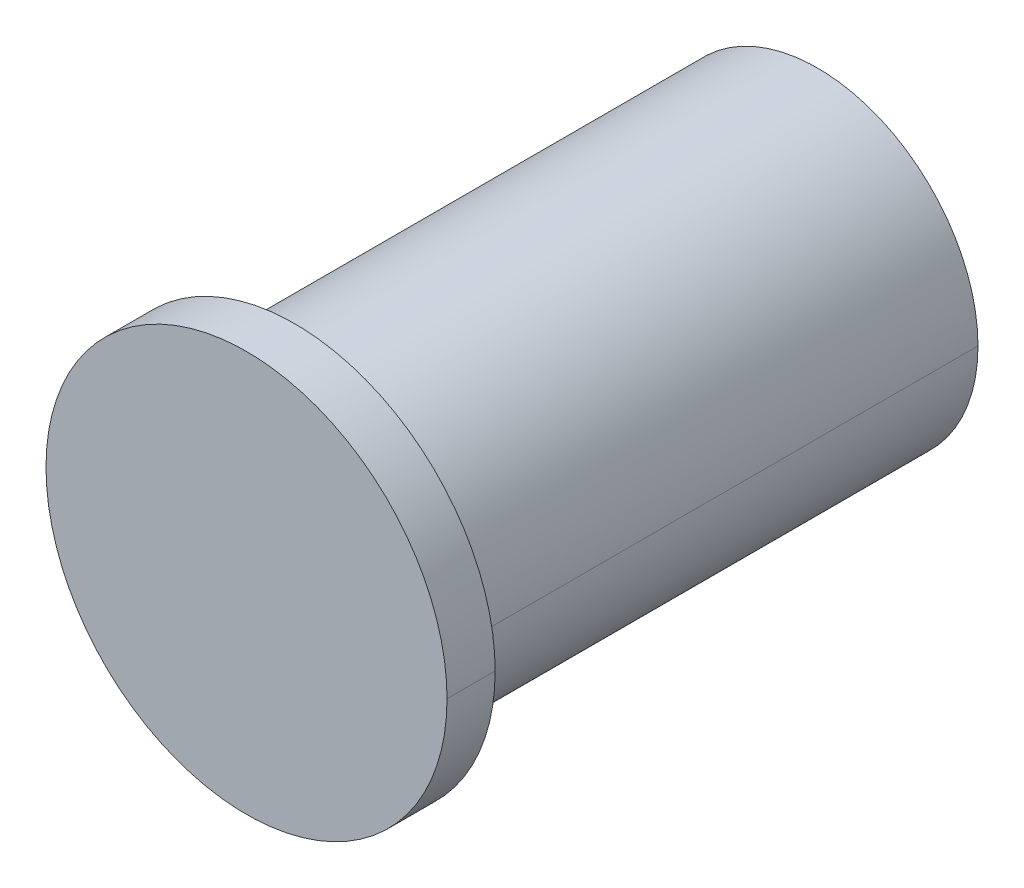
ISO-10303-21;
HEADER;
FILE_DESCRIPTION(('STEP AP214'),'2;1');
FILE_NAME('part.step','',(''),(''),'','','');
FILE_SCHEMA(('AUTOMOTIVE_DESIGN { 1 0 10303 214 1 1 1 1 }'));
ENDSEC;
DATA;
#1=APPLICATION_CONTEXT('core data for automotive mechanical design processes');
#2=APPLICATION_PROTOCOL_DEFINITION('international standard','automotive_design',2000,#1);
#3=PRODUCT_CONTEXT('',#1,'mechanical');
#4=PRODUCT('Part','Part','',(#3));
#5=PRODUCT_RELATED_PRODUCT_CATEGORY('part','',(#4));
#6=PRODUCT_DEFINITION_FORMATION('','',#4);
#7=PRODUCT_DEFINITION_CONTEXT('part definition',#1,'design');
#8=PRODUCT_DEFINITION('design','',#6,#7);
#9=PRODUCT_DEFINITION_SHAPE('','',#8);
#10=(LENGTH_UNIT() NAMED_UNIT(*) SI_UNIT(.MILLI.,.METRE.));
#11=(NAMED_UNIT(*) PLANE_ANGLE_UNIT() SI_UNIT($,.RADIAN.));
#12=(NAMED_UNIT(*) SI_UNIT($,.STERADIAN.) SOLID_ANGLE_UNIT());
#13=UNCERTAINTY_MEASURE_WITH_UNIT(LENGTH_MEASURE(1.E-05),#10,'distance_accuracy_value','');
#14=(GEOMETRIC_REPRESENTATION_CONTEXT(3) GLOBAL_UNCERTAINTY_ASSIGNED_CONTEXT((#13)) GLOBAL_UNIT_ASSIGNED_CONTEXT((#10,
#11,#12)) REPRESENTATION_CONTEXT('',''));
#15=CARTESIAN_POINT('',(0.,0.,0.));
#16=DIRECTION('',(0.,0.,1.));
#17=DIRECTION('',(1.,0.,0.));
#18=AXIS2_PLACEMENT_3D('',#15,#16,#17);
#19=CARTESIAN_POINT('',(0.,0.,-15.24));
#20=DIRECTION('',(0.,0.,1.));
#21=DIRECTION('',(1.,0.,0.));
#22=AXIS2_PLACEMENT_3D('',#19,#20,#21);
#23=PLANE('',#22);
#24=CARTESIAN_POINT('',(0.,0.,-15.24));
#25=DIRECTION('',(0.,0.,1.));
#26=DIRECTION('',(1.,0.,0.));
#27=AXIS2_PLACEMENT_3D('',#24,#25,#26);
#28=CIRCLE('',#27,1.);
#29=CARTESIAN_POINT('',(-1.,0.,-15.24));
#30=VERTEX_POINT('',#29);
#31=CARTESIAN_POINT('',(1.,0.,-15.24));
#32=VERTEX_POINT('',#31);
#33=EDGE_CURVE('E11',#30,#32,#28,.T.);
#34=ORIENTED_EDGE('',*,*,#33,.F.);
#35=CARTESIAN_POINT('',(0.,0.,-15.24));
#36=DIRECTION('',(0.,0.,1.));
#37=DIRECTION('',(1.,0.,0.));
#38=AXIS2_PLACEMENT_3D('',#35,#36,#37);
#39=CIRCLE('',#38,1.);
#40=EDGE_CURVE('E26',#32,#30,#39,.T.);
#41=ORIENTED_EDGE('',*,*,#40,.F.);
#42=EDGE_LOOP('',(#34,#41));
#43=FACE_BOUND('',#42,.T.);
#44=ADVANCED_FACE('F17',(#43),#23,.F.);
#45=CARTESIAN_POINT('',(0.,0.,-15.24));
#46=DIRECTION('',(0.,0.,1.));
#47=DIRECTION('',(0.,-1.,0.));
#48=AXIS2_PLACEMENT_3D('',#45,#46,#47);
#49=CONICAL_SURFACE('',#48,1.,1.24904577239825);
#50=DIRECTION('',(-0.948683298050514,0.,0.316227766016838));
#51=VECTOR('',#50,1.);
#52=CARTESIAN_POINT('',(-1.,0.,-15.24));
#53=LINE('',#52,#51);
#54=CARTESIAN_POINT('',(-4.,0.,-14.24));
#55=VERTEX_POINT('',#54);
#56=EDGE_CURVE('E152',#30,#55,#53,.T.);
#57=ORIENTED_EDGE('',*,*,#56,.T.);
#58=CARTESIAN_POINT('',(0.,0.,-14.24));
#59=DIRECTION('',(0.,0.,1.));
#60=DIRECTION('',(1.,0.,0.));
#61=AXIS2_PLACEMENT_3D('',#58,#59,#60);
#62=CIRCLE('',#61,4.);
#63=CARTESIAN_POINT('',(4.,0.,-14.24));
#64=VERTEX_POINT('',#63);
#65=EDGE_CURVE('E146',#64,#55,#62,.T.);
#66=ORIENTED_EDGE('',*,*,#65,.F.);
#67=DIRECTION('',(0.948683298050514,0.,0.316227766016838));
#68=VECTOR('',#67,1.);
#69=CARTESIAN_POINT('',(1.,0.,-15.24));
#70=LINE('',#69,#68);
#71=EDGE_CURVE('E140',#32,#64,#70,.T.);
#72=ORIENTED_EDGE('',*,*,#71,.F.);
#73=ORIENTED_EDGE('',*,*,#40,.T.);
#74=EDGE_LOOP('',(#57,#66,#72,#73));
#75=FACE_BOUND('',#74,.T.);
#76=ADVANCED_FACE('F163',(#75),#49,.T.);
#77=CARTESIAN_POINT('',(0.,0.,-15.24));
#78=DIRECTION('',(0.,0.,1.));
#79=DIRECTION('',(0.,1.,0.));
#80=AXIS2_PLACEMENT_3D('',#77,#78,#79);
#81=CONICAL_SURFACE('',#80,1.,1.24904577239825);
#82=ORIENTED_EDGE('',*,*,#56,.F.);
#83=ORIENTED_EDGE('',*,*,#33,.T.);
#84=ORIENTED_EDGE('',*,*,#71,.T.);
#85=CARTESIAN_POINT('',(0.,0.,-14.24));
#86=DIRECTION('',(0.,0.,1.));
#87=DIRECTION('',(1.,0.,0.));
#88=AXIS2_PLACEMENT_3D('',#85,#86,#87);
#89=CIRCLE('',#88,4.);
#90=EDGE_CURVE('E135',#55,#64,#89,.T.);
#91=ORIENTED_EDGE('',*,*,#90,.F.);
#92=EDGE_LOOP('',(#82,#83,#84,#91));
#93=FACE_BOUND('',#92,.T.);
#94=ADVANCED_FACE('F167',(#93),#81,.T.);
#95=CARTESIAN_POINT('',(0.,0.,50.));
#96=DIRECTION('',(0.,0.,1.));
#97=DIRECTION('',(0.,1.,0.));
#98=AXIS2_PLACEMENT_3D('',#95,#96,#97);
#99=CYLINDRICAL_SURFACE('',#98,4.);
#100=DIRECTION('',(0.,0.,1.));
#101=VECTOR('',#100,1.);
#102=CARTESIAN_POINT('',(-4.,0.,-14.24));
#103=LINE('',#102,#101);
#104=CARTESIAN_POINT('',(-4.,0.,-1.2));
#105=VERTEX_POINT('',#104);
#106=EDGE_CURVE('E130',#55,#105,#103,.T.);
#107=ORIENTED_EDGE('',*,*,#106,.F.);
#108=ORIENTED_EDGE('',*,*,#90,.T.);
#109=DIRECTION('',(0.,0.,1.));
#110=VECTOR('',#109,1.);
#111=CARTESIAN_POINT('',(4.,0.,-14.24));
#112=LINE('',#111,#110);
#113=CARTESIAN_POINT('',(4.,0.,-1.2));
#114=VERTEX_POINT('',#113);
#115=EDGE_CURVE('E125',#64,#114,#112,.T.);
#116=ORIENTED_EDGE('',*,*,#115,.T.);
#117=CARTESIAN_POINT('',(0.,0.,-1.2));
#118=DIRECTION('',(0.,0.,1.));
#119=DIRECTION('',(1.,0.,0.));
#120=AXIS2_PLACEMENT_3D('',#117,#118,#119);
#121=CIRCLE('',#120,4.);
#122=EDGE_CURVE('E120',#105,#114,#121,.T.);
#123=ORIENTED_EDGE('',*,*,#122,.F.);
#124=EDGE_LOOP('',(#107,#108,#116,#123));
#125=FACE_BOUND('',#124,.T.);
#126=ADVANCED_FACE('F170',(#125),#99,.T.);
#127=CARTESIAN_POINT('',(4.,0.,-1.2));
#128=DIRECTION('',(0.,0.,1.));
#129=DIRECTION('',(1.,0.,0.));
#130=AXIS2_PLACEMENT_3D('',#127,#128,#129);
#131=PLANE('',#130);
#132=CARTESIAN_POINT('',(0.,0.,-1.2));
#133=DIRECTION('',(0.,0.,1.));
#134=DIRECTION('',(1.,0.,0.));
#135=AXIS2_PLACEMENT_3D('',#132,#133,#134);
#136=CIRCLE('',#135,5.);
#137=CARTESIAN_POINT('',(-5.,0.,-1.2));
#138=VERTEX_POINT('',#137);
#139=CARTESIAN_POINT('',(5.,0.,-1.2));
#140=VERTEX_POINT('',#139);
#141=EDGE_CURVE('E87',#138,#140,#136,.T.);
#142=ORIENTED_EDGE('',*,*,#141,.F.);
#143=CARTESIAN_POINT('',(0.,0.,-1.2));
#144=DIRECTION('',(0.,0.,1.));
#145=DIRECTION('',(1.,0.,0.));
#146=AXIS2_PLACEMENT_3D('',#143,#144,#145);
#147=CIRCLE('',#146,5.);
#148=EDGE_CURVE('E111',#140,#138,#147,.T.);
#149=ORIENTED_EDGE('',*,*,#148,.F.);
#150=EDGE_LOOP('',(#142,#149));
#151=FACE_BOUND('',#150,.T.);
#152=CARTESIAN_POINT('',(0.,0.,-1.2));
#153=DIRECTION('',(0.,0.,1.));
#154=DIRECTION('',(1.,0.,0.));
#155=AXIS2_PLACEMENT_3D('',#152,#153,#154);
#156=CIRCLE('',#155,4.);
#157=EDGE_CURVE('E105',#114,#105,#156,.T.);
#158=ORIENTED_EDGE('',*,*,#157,.T.);
#159=ORIENTED_EDGE('',*,*,#122,.T.);
#160=EDGE_LOOP('',(#158,#159));
#161=FACE_BOUND('',#160,.T.);
#162=ADVANCED_FACE('F175',(#151,#161),#131,.F.);
#163=CARTESIAN_POINT('',(0.,0.,50.));
#164=DIRECTION('',(0.,0.,1.));
#165=DIRECTION('',(5.8935951136395E-10,-1.,0.));
#166=AXIS2_PLACEMENT_3D('',#163,#164,#165);
#167=CYLINDRICAL_SURFACE('',#166,4.);
#168=ORIENTED_EDGE('',*,*,#106,.T.);
#169=ORIENTED_EDGE('',*,*,#157,.F.);
#170=ORIENTED_EDGE('',*,*,#115,.F.);
#171=ORIENTED_EDGE('',*,*,#65,.T.);
#172=EDGE_LOOP('',(#168,#169,#170,#171));
#173=FACE_BOUND('',#172,.T.);
#174=ADVANCED_FACE('F173',(#173),#167,.T.);
#175=CARTESIAN_POINT('',(0.,0.,50.));
#176=DIRECTION('',(0.,0.,1.));
#177=DIRECTION('',(0.,-1.,0.));
#178=AXIS2_PLACEMENT_3D('',#175,#176,#177);
#179=CYLINDRICAL_SURFACE('',#178,5.);
#180=DIRECTION('',(0.,0.,1.));
#181=VECTOR('',#180,1.);
#182=CARTESIAN_POINT('',(-5.,0.,-1.2));
#183=LINE('',#182,#181);
#184=CARTESIAN_POINT('',(-5.,0.,0.));
#185=VERTEX_POINT('',#184);
#186=EDGE_CURVE('E78',#138,#185,#183,.T.);
#187=ORIENTED_EDGE('',*,*,#186,.T.);
#188=CARTESIAN_POINT('',(0.,0.,0.));
#189=DIRECTION('',(0.,0.,1.));
#190=DIRECTION('',(1.,0.,0.));
#191=AXIS2_PLACEMENT_3D('',#188,#189,#190);
#192=CIRCLE('',#191,5.);
#193=CARTESIAN_POINT('',(5.,0.,0.));
#194=VERTEX_POINT('',#193);
#195=EDGE_CURVE('E71',#194,#185,#192,.T.);
#196=ORIENTED_EDGE('',*,*,#195,.F.);
#197=DIRECTION('',(0.,0.,1.));
#198=VECTOR('',#197,1.);
#199=CARTESIAN_POINT('',(5.,0.,-1.2));
#200=LINE('',#199,#198);
#201=EDGE_CURVE('E75',#140,#194,#200,.T.);
#202=ORIENTED_EDGE('',*,*,#201,.F.);
#203=ORIENTED_EDGE('',*,*,#148,.T.);
#204=EDGE_LOOP('',(#187,#196,#202,#203));
#205=FACE_BOUND('',#204,.T.);
#206=ADVANCED_FACE('F73',(#205),#179,.T.);
#207=CARTESIAN_POINT('',(0.,0.,50.));
#208=DIRECTION('',(0.,0.,1.));
#209=DIRECTION('',(0.,1.,0.));
#210=AXIS2_PLACEMENT_3D('',#207,#208,#209);
#211=CYLINDRICAL_SURFACE('',#210,5.);
#212=ORIENTED_EDGE('',*,*,#186,.F.);
#213=ORIENTED_EDGE('',*,*,#141,.T.);
#214=ORIENTED_EDGE('',*,*,#201,.T.);
#215=CARTESIAN_POINT('',(0.,0.,0.));
#216=DIRECTION('',(0.,0.,1.));
#217=DIRECTION('',(1.,0.,0.));
#218=AXIS2_PLACEMENT_3D('',#215,#216,#217);
#219=CIRCLE('',#218,5.);
#220=EDGE_CURVE('E86',#185,#194,#219,.T.);
#221=ORIENTED_EDGE('',*,*,#220,.F.);
#222=EDGE_LOOP('',(#212,#213,#214,#221));
#223=FACE_BOUND('',#222,.T.);
#224=ADVANCED_FACE('F85',(#223),#211,.T.);
#225=CARTESIAN_POINT('',(5.,0.,0.));
#226=DIRECTION('',(0.,0.,-1.));
#227=DIRECTION('',(-1.,0.,0.));
#228=AXIS2_PLACEMENT_3D('',#225,#226,#227);
#229=PLANE('',#228);
#230=ORIENTED_EDGE('',*,*,#195,.T.);
#231=ORIENTED_EDGE('',*,*,#220,.T.);
#232=EDGE_LOOP('',(#230,#231));
#233=FACE_BOUND('',#232,.T.);
#234=ADVANCED_FACE('F90',(#233),#229,.F.);
#235=CLOSED_SHELL('',(#44,#76,#94,#126,#162,#174,#206,#224,#234));
#236=MANIFOLD_SOLID_BREP('B1',#235);
#237=ADVANCED_BREP_SHAPE_REPRESENTATION('',(#18,#236),#14);
#238=SHAPE_DEFINITION_REPRESENTATION(#9,#237);
ENDSEC;
END-ISO-10303-21;
